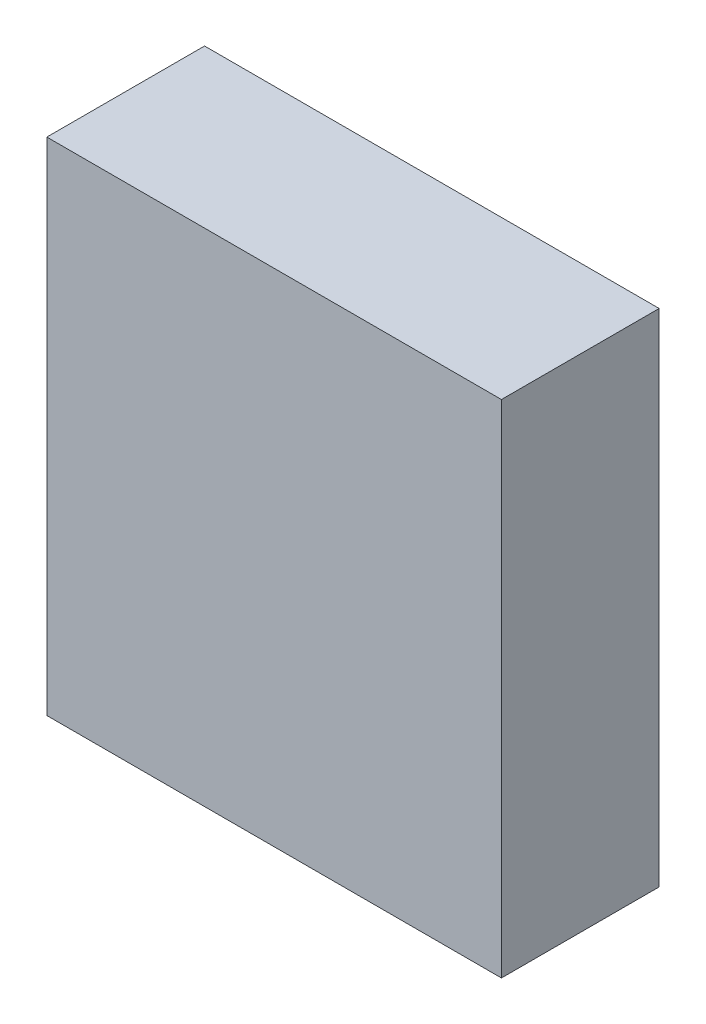
ISO-10303-21;
HEADER;
FILE_DESCRIPTION(('STEP AP214'),'2;1');
FILE_NAME('part.step','',(''),(''),'','','');
FILE_SCHEMA(('AUTOMOTIVE_DESIGN { 1 0 10303 214 1 1 1 1 }'));
ENDSEC;
DATA;
#1=APPLICATION_CONTEXT('core data for automotive mechanical design processes');
#2=APPLICATION_PROTOCOL_DEFINITION('international standard','automotive_design',2000,#1);
#3=PRODUCT_CONTEXT('',#1,'mechanical');
#4=PRODUCT('Part','Part','',(#3));
#5=PRODUCT_RELATED_PRODUCT_CATEGORY('part','',(#4));
#6=PRODUCT_DEFINITION_FORMATION('','',#4);
#7=PRODUCT_DEFINITION_CONTEXT('part definition',#1,'design');
#8=PRODUCT_DEFINITION('design','',#6,#7);
#9=PRODUCT_DEFINITION_SHAPE('','',#8);
#10=(LENGTH_UNIT() NAMED_UNIT(*) SI_UNIT(.MILLI.,.METRE.));
#11=(NAMED_UNIT(*) PLANE_ANGLE_UNIT() SI_UNIT($,.RADIAN.));
#12=(NAMED_UNIT(*) SI_UNIT($,.STERADIAN.) SOLID_ANGLE_UNIT());
#13=UNCERTAINTY_MEASURE_WITH_UNIT(LENGTH_MEASURE(1.E-05),#10,'distance_accuracy_value','');
#14=(GEOMETRIC_REPRESENTATION_CONTEXT(3) GLOBAL_UNCERTAINTY_ASSIGNED_CONTEXT((#13)) GLOBAL_UNIT_ASSIGNED_CONTEXT((#10,
#11,#12)) REPRESENTATION_CONTEXT('',''));
#15=CARTESIAN_POINT('',(0.,0.,0.));
#16=DIRECTION('',(0.,0.,1.));
#17=DIRECTION('',(1.,0.,0.));
#18=AXIS2_PLACEMENT_3D('',#15,#16,#17);
#19=CARTESIAN_POINT('',(-2.45001088300448,2.70000519002525,0.));
#20=DIRECTION('',(-1.,8.74227765734759E-08,0.));
#21=DIRECTION('',(-8.74227765734759E-08,-1.,0.));
#22=AXIS2_PLACEMENT_3D('',#19,#20,#21);
#23=PLANE('',#22);
#24=DIRECTION('',(-8.74227765512293E-08,-0.999999999999996,0.));
#25=VECTOR('',#24,1.);
#26=CARTESIAN_POINT('',(-2.45001088300448,2.70000519002525,0.));
#27=LINE('',#26,#25);
#28=CARTESIAN_POINT('',(-2.45001088300448,2.70000519002525,0.));
#29=VERTEX_POINT('',#28);
#30=CARTESIAN_POINT('',(-2.45001135508694,-2.69998870645912,0.));
#31=VERTEX_POINT('',#30);
#32=EDGE_CURVE('E11',#29,#31,#27,.T.);
#33=ORIENTED_EDGE('',*,*,#32,.T.);
#34=DIRECTION('',(0.,0.,1.));
#35=VECTOR('',#34,1.);
#36=CARTESIAN_POINT('',(-2.45001135508694,-2.69998870645912,0.));
#37=LINE('',#36,#35);
#38=CARTESIAN_POINT('',(-2.45001135508694,-2.69998870645912,1.6999990940094));
#39=VERTEX_POINT('',#38);
#40=EDGE_CURVE('E88',#31,#39,#37,.T.);
#41=ORIENTED_EDGE('',*,*,#40,.T.);
#42=DIRECTION('',(-8.74227765512293E-08,-0.999999999999996,0.));
#43=VECTOR('',#42,1.);
#44=CARTESIAN_POINT('',(-2.45001088300448,2.70000519002525,1.6999990940094));
#45=LINE('',#44,#43);
#46=CARTESIAN_POINT('',(-2.45001088300448,2.70000519002525,1.6999990940094));
#47=VERTEX_POINT('',#46);
#48=EDGE_CURVE('E83',#47,#39,#45,.T.);
#49=ORIENTED_EDGE('',*,*,#48,.F.);
#50=DIRECTION('',(0.,0.,1.));
#51=VECTOR('',#50,1.);
#52=CARTESIAN_POINT('',(-2.45001088300448,2.70000519002525,0.));
#53=LINE('',#52,#51);
#54=EDGE_CURVE('E72',#29,#47,#53,.T.);
#55=ORIENTED_EDGE('',*,*,#54,.F.);
#56=EDGE_LOOP('',(#33,#41,#49,#55));
#57=FACE_BOUND('',#56,.T.);
#58=ADVANCED_FACE('F17',(#57),#23,.T.);
#59=CARTESIAN_POINT('',(-2.45001135508694,-2.69998870645912,0.));
#60=DIRECTION('',(-8.74227765734759E-08,-1.,0.));
#61=DIRECTION('',(1.,-8.74227765734759E-08,0.));
#62=AXIS2_PLACEMENT_3D('',#59,#60,#61);
#63=PLANE('',#62);
#64=DIRECTION('',(0.999999999999996,-8.74227765649347E-08,0.));
#65=VECTOR('',#64,1.);
#66=CARTESIAN_POINT('',(-2.45001135508694,-2.69998870645912,0.));
#67=LINE('',#66,#65);
#68=CARTESIAN_POINT('',(2.44999780018649,-2.69998913483153,0.));
#69=VERTEX_POINT('',#68);
#70=EDGE_CURVE('E24',#31,#69,#67,.T.);
#71=ORIENTED_EDGE('',*,*,#70,.T.);
#72=DIRECTION('',(0.,0.,1.));
#73=VECTOR('',#72,1.);
#74=CARTESIAN_POINT('',(2.44999780018649,-2.69998913483153,0.));
#75=LINE('',#74,#73);
#76=CARTESIAN_POINT('',(2.44999780018649,-2.69998913483153,1.6999990940094));
#77=VERTEX_POINT('',#76);
#78=EDGE_CURVE('E85',#69,#77,#75,.T.);
#79=ORIENTED_EDGE('',*,*,#78,.T.);
#80=DIRECTION('',(0.999999999999996,-8.74227765649347E-08,0.));
#81=VECTOR('',#80,1.);
#82=CARTESIAN_POINT('',(-2.45001135508694,-2.69998870645912,1.6999990940094));
#83=LINE('',#82,#81);
#84=EDGE_CURVE('E66',#39,#77,#83,.T.);
#85=ORIENTED_EDGE('',*,*,#84,.F.);
#86=ORIENTED_EDGE('',*,*,#40,.F.);
#87=EDGE_LOOP('',(#71,#79,#85,#86));
#88=FACE_BOUND('',#87,.T.);
#89=ADVANCED_FACE('F89',(#88),#63,.T.);
#90=CARTESIAN_POINT('',(2.44999780018649,-2.69998913483153,0.));
#91=DIRECTION('',(1.,-8.74227765734759E-08,0.));
#92=DIRECTION('',(8.74227765734759E-08,1.,0.));
#93=AXIS2_PLACEMENT_3D('',#90,#91,#92);
#94=PLANE('',#93);
#95=DIRECTION('',(8.74227765512293E-08,0.999999999999996,0.));
#96=VECTOR('',#95,1.);
#97=CARTESIAN_POINT('',(2.44999780018649,-2.69998913483153,0.));
#98=LINE('',#97,#96);
#99=CARTESIAN_POINT('',(2.44999827226896,2.70000476165285,0.));
#100=VERTEX_POINT('',#99);
#101=EDGE_CURVE('E62',#69,#100,#98,.T.);
#102=ORIENTED_EDGE('',*,*,#101,.T.);
#103=DIRECTION('',(0.,0.,1.));
#104=VECTOR('',#103,1.);
#105=CARTESIAN_POINT('',(2.44999827226895,2.70000476165285,0.));
#106=LINE('',#105,#104);
#107=CARTESIAN_POINT('',(2.44999827226896,2.70000476165285,1.6999990940094));
#108=VERTEX_POINT('',#107);
#109=EDGE_CURVE('E55',#100,#108,#106,.T.);
#110=ORIENTED_EDGE('',*,*,#109,.T.);
#111=DIRECTION('',(8.74227765512293E-08,0.999999999999996,0.));
#112=VECTOR('',#111,1.);
#113=CARTESIAN_POINT('',(2.44999780018649,-2.69998913483153,1.6999990940094));
#114=LINE('',#113,#112);
#115=EDGE_CURVE('E59',#77,#108,#114,.T.);
#116=ORIENTED_EDGE('',*,*,#115,.F.);
#117=ORIENTED_EDGE('',*,*,#78,.F.);
#118=EDGE_LOOP('',(#102,#110,#116,#117));
#119=FACE_BOUND('',#118,.T.);
#120=ADVANCED_FACE('F57',(#119),#94,.T.);
#121=CARTESIAN_POINT('',(2.44999827226896,2.70000476165285,0.));
#122=DIRECTION('',(8.74227765734759E-08,1.,0.));
#123=DIRECTION('',(-1.,8.74227765734759E-08,0.));
#124=AXIS2_PLACEMENT_3D('',#121,#122,#123);
#125=PLANE('',#124);
#126=DIRECTION('',(-0.999999999999996,8.74227765649347E-08,0.));
#127=VECTOR('',#126,1.);
#128=CARTESIAN_POINT('',(2.44999827226896,2.70000476165285,0.));
#129=LINE('',#128,#127);
#130=EDGE_CURVE('E65',#100,#29,#129,.T.);
#131=ORIENTED_EDGE('',*,*,#130,.T.);
#132=ORIENTED_EDGE('',*,*,#54,.T.);
#133=DIRECTION('',(-0.999999999999996,8.74227765649347E-08,0.));
#134=VECTOR('',#133,1.);
#135=CARTESIAN_POINT('',(2.44999827226896,2.70000476165285,1.6999990940094));
#136=LINE('',#135,#134);
#137=EDGE_CURVE('E70',#108,#47,#136,.T.);
#138=ORIENTED_EDGE('',*,*,#137,.F.);
#139=ORIENTED_EDGE('',*,*,#109,.F.);
#140=EDGE_LOOP('',(#131,#132,#138,#139));
#141=FACE_BOUND('',#140,.T.);
#142=ADVANCED_FACE('F71',(#141),#125,.T.);
#143=CARTESIAN_POINT('',(91.8250045776367,74.8249969482422,1.6999990940094));
#144=DIRECTION('',(0.,0.,1.));
#145=DIRECTION('',(-1.,8.74227765734759E-08,0.));
#146=AXIS2_PLACEMENT_3D('',#143,#144,#145);
#147=PLANE('',#146);
#148=ORIENTED_EDGE('',*,*,#48,.T.);
#149=ORIENTED_EDGE('',*,*,#84,.T.);
#150=ORIENTED_EDGE('',*,*,#115,.T.);
#151=ORIENTED_EDGE('',*,*,#137,.T.);
#152=EDGE_LOOP('',(#148,#149,#150,#151));
#153=FACE_BOUND('',#152,.T.);
#154=ADVANCED_FACE('F76',(#153),#147,.T.);
#155=CARTESIAN_POINT('',(91.8250045776367,74.8249969482422,0.));
#156=DIRECTION('',(0.,0.,1.));
#157=DIRECTION('',(-1.,8.74227765734759E-08,0.));
#158=AXIS2_PLACEMENT_3D('',#155,#156,#157);
#159=PLANE('',#158);
#160=ORIENTED_EDGE('',*,*,#130,.F.);
#161=ORIENTED_EDGE('',*,*,#101,.F.);
#162=ORIENTED_EDGE('',*,*,#70,.F.);
#163=ORIENTED_EDGE('',*,*,#32,.F.);
#164=EDGE_LOOP('',(#160,#161,#162,#163));
#165=FACE_BOUND('',#164,.T.);
#166=ADVANCED_FACE('F91',(#165),#159,.F.);
#167=CLOSED_SHELL('',(#58,#89,#120,#142,#154,#166));
#168=MANIFOLD_SOLID_BREP('B1',#167);
#169=ADVANCED_BREP_SHAPE_REPRESENTATION('',(#18,#168),#14);
#170=SHAPE_DEFINITION_REPRESENTATION(#9,#169);
ENDSEC;
END-ISO-10303-21;
